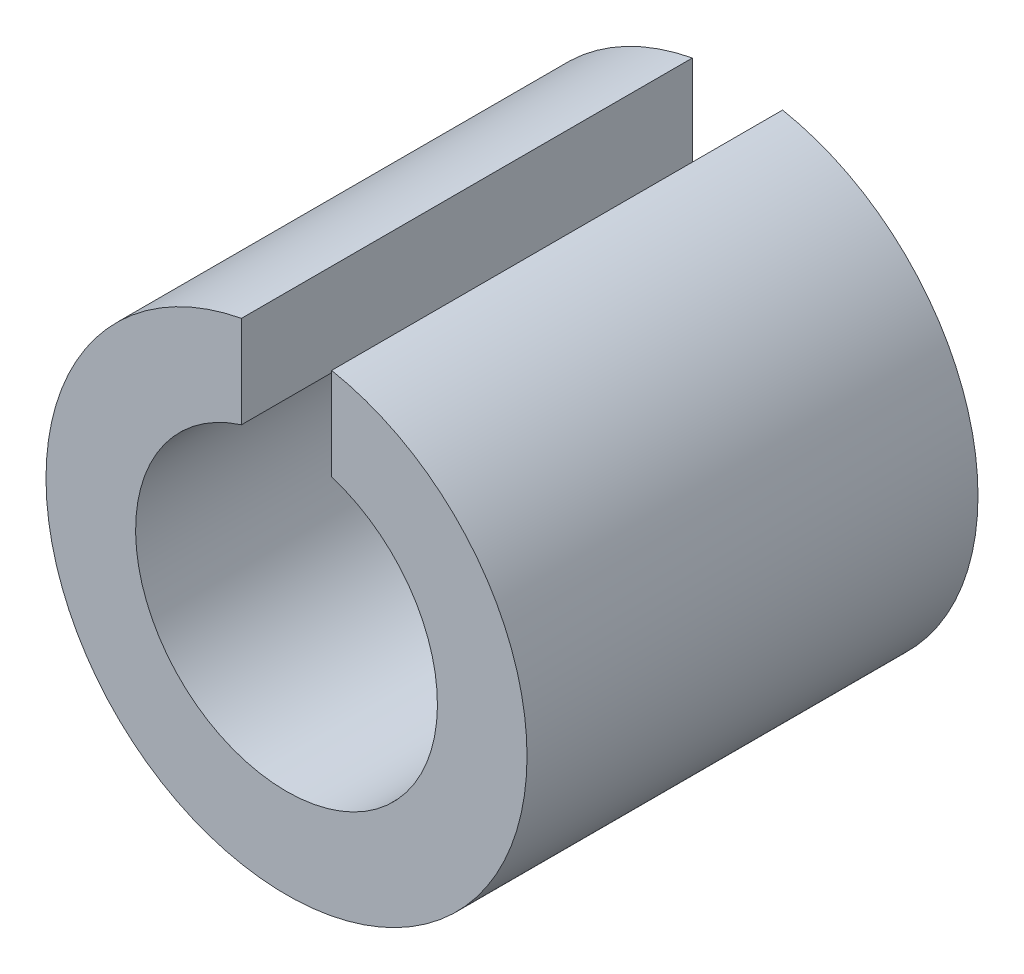
ISO-10303-21;
HEADER;
FILE_DESCRIPTION(('STEP AP214'),'2;1');
FILE_NAME('part.step','',(''),(''),'','','');
FILE_SCHEMA(('AUTOMOTIVE_DESIGN { 1 0 10303 214 1 1 1 1 }'));
ENDSEC;
DATA;
#1=APPLICATION_CONTEXT('core data for automotive mechanical design processes');
#2=APPLICATION_PROTOCOL_DEFINITION('international standard','automotive_design',2000,#1);
#3=PRODUCT_CONTEXT('',#1,'mechanical');
#4=PRODUCT('Part','Part','',(#3));
#5=PRODUCT_RELATED_PRODUCT_CATEGORY('part','',(#4));
#6=PRODUCT_DEFINITION_FORMATION('','',#4);
#7=PRODUCT_DEFINITION_CONTEXT('part definition',#1,'design');
#8=PRODUCT_DEFINITION('design','',#6,#7);
#9=PRODUCT_DEFINITION_SHAPE('','',#8);
#10=(LENGTH_UNIT() NAMED_UNIT(*) SI_UNIT(.MILLI.,.METRE.));
#11=(NAMED_UNIT(*) PLANE_ANGLE_UNIT() SI_UNIT($,.RADIAN.));
#12=(NAMED_UNIT(*) SI_UNIT($,.STERADIAN.) SOLID_ANGLE_UNIT());
#13=UNCERTAINTY_MEASURE_WITH_UNIT(LENGTH_MEASURE(1.E-05),#10,'distance_accuracy_value','');
#14=(GEOMETRIC_REPRESENTATION_CONTEXT(3) GLOBAL_UNCERTAINTY_ASSIGNED_CONTEXT((#13)) GLOBAL_UNIT_ASSIGNED_CONTEXT((#10,
#11,#12)) REPRESENTATION_CONTEXT('',''));
#15=CARTESIAN_POINT('',(0.,0.,0.));
#16=DIRECTION('',(0.,0.,1.));
#17=DIRECTION('',(1.,0.,0.));
#18=AXIS2_PLACEMENT_3D('',#15,#16,#17);
#19=CARTESIAN_POINT('',(0.75,3.92905841137543,3.75));
#20=DIRECTION('',(1.,0.,0.));
#21=DIRECTION('',(0.,1.,0.));
#22=AXIS2_PLACEMENT_3D('',#19,#20,#21);
#23=PLANE('',#22);
#24=DIRECTION('',(0.,0.,-1.));
#25=VECTOR('',#24,1.);
#26=CARTESIAN_POINT('',(0.75,2.39532878745278,3.75));
#27=LINE('',#26,#25);
#28=CARTESIAN_POINT('',(0.75,2.39532878745278,-3.75));
#29=VERTEX_POINT('',#28);
#30=CARTESIAN_POINT('',(0.75,2.39532878745278,3.75));
#31=VERTEX_POINT('',#30);
#32=EDGE_CURVE('E60',#29,#31,#27,.F.);
#33=ORIENTED_EDGE('',*,*,#32,.T.);
#34=DIRECTION('',(0.,1.,0.));
#35=VECTOR('',#34,1.);
#36=CARTESIAN_POINT('',(0.75,3.92905841137543,3.75));
#37=LINE('',#36,#35);
#38=CARTESIAN_POINT('',(0.75,3.92905841137543,3.75));
#39=VERTEX_POINT('',#38);
#40=EDGE_CURVE('E67',#39,#31,#37,.F.);
#41=ORIENTED_EDGE('',*,*,#40,.F.);
#42=DIRECTION('',(0.,0.,-1.));
#43=VECTOR('',#42,1.);
#44=CARTESIAN_POINT('',(0.75,3.92905841137543,3.75));
#45=LINE('',#44,#43);
#46=CARTESIAN_POINT('',(0.75,3.92905841137543,-3.75));
#47=VERTEX_POINT('',#46);
#48=EDGE_CURVE('E65',#47,#39,#45,.F.);
#49=ORIENTED_EDGE('',*,*,#48,.F.);
#50=DIRECTION('',(0.,1.,0.));
#51=VECTOR('',#50,1.);
#52=CARTESIAN_POINT('',(0.75,3.92905841137543,-3.75));
#53=LINE('',#52,#51);
#54=EDGE_CURVE('E35',#29,#47,#53,.T.);
#55=ORIENTED_EDGE('',*,*,#54,.F.);
#56=EDGE_LOOP('',(#33,#41,#49,#55));
#57=FACE_BOUND('',#56,.T.);
#58=ADVANCED_FACE('F17',(#57),#23,.F.);
#59=CARTESIAN_POINT('',(-0.75,2.39532878745278,3.75));
#60=DIRECTION('',(-1.,0.,0.));
#61=DIRECTION('',(0.,-1.,0.));
#62=AXIS2_PLACEMENT_3D('',#59,#60,#61);
#63=PLANE('',#62);
#64=DIRECTION('',(0.,0.,-1.));
#65=VECTOR('',#64,1.);
#66=CARTESIAN_POINT('',(-0.75,3.92905841137543,3.75));
#67=LINE('',#66,#65);
#68=CARTESIAN_POINT('',(-0.75,3.92905841137543,3.75));
#69=VERTEX_POINT('',#68);
#70=CARTESIAN_POINT('',(-0.75,3.92905841137543,-3.75));
#71=VERTEX_POINT('',#70);
#72=EDGE_CURVE('E77',#69,#71,#67,.T.);
#73=ORIENTED_EDGE('',*,*,#72,.F.);
#74=DIRECTION('',(0.,1.,0.));
#75=VECTOR('',#74,1.);
#76=CARTESIAN_POINT('',(-0.75,0.,3.75));
#77=LINE('',#76,#75);
#78=CARTESIAN_POINT('',(-0.75,2.39532878745278,3.75));
#79=VERTEX_POINT('',#78);
#80=EDGE_CURVE('E64',#79,#69,#77,.T.);
#81=ORIENTED_EDGE('',*,*,#80,.F.);
#82=DIRECTION('',(0.,0.,-1.));
#83=VECTOR('',#82,1.);
#84=CARTESIAN_POINT('',(-0.75,2.39532878745278,3.75));
#85=LINE('',#84,#83);
#86=CARTESIAN_POINT('',(-0.75,2.39532878745278,-3.75));
#87=VERTEX_POINT('',#86);
#88=EDGE_CURVE('E55',#79,#87,#85,.T.);
#89=ORIENTED_EDGE('',*,*,#88,.T.);
#90=DIRECTION('',(0.,-1.,0.));
#91=VECTOR('',#90,1.);
#92=CARTESIAN_POINT('',(-0.75,2.39532878745278,-3.75));
#93=LINE('',#92,#91);
#94=EDGE_CURVE('E73',#71,#87,#93,.T.);
#95=ORIENTED_EDGE('',*,*,#94,.F.);
#96=EDGE_LOOP('',(#73,#81,#89,#95));
#97=FACE_BOUND('',#96,.T.);
#98=ADVANCED_FACE('F89',(#97),#63,.F.);
#99=CARTESIAN_POINT('',(0.,0.,3.75));
#100=DIRECTION('',(0.,0.,-1.));
#101=DIRECTION('',(-1.,0.,0.));
#102=AXIS2_PLACEMENT_3D('',#99,#100,#101);
#103=CYLINDRICAL_SURFACE('',#102,2.51);
#104=CARTESIAN_POINT('',(0.,0.,3.75));
#105=DIRECTION('',(0.,0.,-1.));
#106=DIRECTION('',(-1.,0.,0.));
#107=AXIS2_PLACEMENT_3D('',#104,#105,#106);
#108=CIRCLE('',#107,2.51);
#109=EDGE_CURVE('E20',#31,#79,#108,.T.);
#110=ORIENTED_EDGE('',*,*,#109,.F.);
#111=ORIENTED_EDGE('',*,*,#32,.F.);
#112=CARTESIAN_POINT('',(0.,0.,-3.75));
#113=DIRECTION('',(0.,0.,-1.));
#114=DIRECTION('',(-1.,0.,0.));
#115=AXIS2_PLACEMENT_3D('',#112,#113,#114);
#116=CIRCLE('',#115,2.51);
#117=EDGE_CURVE('E79',#29,#87,#116,.T.);
#118=ORIENTED_EDGE('',*,*,#117,.T.);
#119=ORIENTED_EDGE('',*,*,#88,.F.);
#120=EDGE_LOOP('',(#110,#111,#118,#119));
#121=FACE_BOUND('',#120,.T.);
#122=ADVANCED_FACE('F59',(#121),#103,.F.);
#123=CARTESIAN_POINT('',(0.,0.,3.75));
#124=DIRECTION('',(0.,0.,1.));
#125=DIRECTION('',(1.,0.,0.));
#126=AXIS2_PLACEMENT_3D('',#123,#124,#125);
#127=PLANE('',#126);
#128=CARTESIAN_POINT('',(0.,0.,3.75));
#129=DIRECTION('',(0.,0.,-1.));
#130=DIRECTION('',(-1.,0.,0.));
#131=AXIS2_PLACEMENT_3D('',#128,#129,#130);
#132=CIRCLE('',#131,4.);
#133=EDGE_CURVE('E26',#39,#69,#132,.T.);
#134=ORIENTED_EDGE('',*,*,#133,.F.);
#135=ORIENTED_EDGE('',*,*,#40,.T.);
#136=ORIENTED_EDGE('',*,*,#109,.T.);
#137=ORIENTED_EDGE('',*,*,#80,.T.);
#138=EDGE_LOOP('',(#134,#135,#136,#137));
#139=FACE_BOUND('',#138,.T.);
#140=ADVANCED_FACE('F68',(#139),#127,.T.);
#141=CARTESIAN_POINT('',(0.,0.,-3.75));
#142=DIRECTION('',(0.,0.,1.));
#143=DIRECTION('',(1.,0.,0.));
#144=AXIS2_PLACEMENT_3D('',#141,#142,#143);
#145=PLANE('',#144);
#146=ORIENTED_EDGE('',*,*,#54,.T.);
#147=CARTESIAN_POINT('',(0.,0.,-3.75));
#148=DIRECTION('',(0.,0.,-1.));
#149=DIRECTION('',(-1.,0.,0.));
#150=AXIS2_PLACEMENT_3D('',#147,#148,#149);
#151=CIRCLE('',#150,4.);
#152=EDGE_CURVE('E11',#71,#47,#151,.F.);
#153=ORIENTED_EDGE('',*,*,#152,.F.);
#154=ORIENTED_EDGE('',*,*,#94,.T.);
#155=ORIENTED_EDGE('',*,*,#117,.F.);
#156=EDGE_LOOP('',(#146,#153,#154,#155));
#157=FACE_BOUND('',#156,.T.);
#158=ADVANCED_FACE('F86',(#157),#145,.F.);
#159=CARTESIAN_POINT('',(0.,0.,3.75));
#160=DIRECTION('',(0.,0.,-1.));
#161=DIRECTION('',(-1.,0.,0.));
#162=AXIS2_PLACEMENT_3D('',#159,#160,#161);
#163=CYLINDRICAL_SURFACE('',#162,4.);
#164=ORIENTED_EDGE('',*,*,#133,.T.);
#165=ORIENTED_EDGE('',*,*,#72,.T.);
#166=ORIENTED_EDGE('',*,*,#152,.T.);
#167=ORIENTED_EDGE('',*,*,#48,.T.);
#168=EDGE_LOOP('',(#164,#165,#166,#167));
#169=FACE_BOUND('',#168,.T.);
#170=ADVANCED_FACE('F91',(#169),#163,.T.);
#171=CLOSED_SHELL('',(#58,#98,#122,#140,#158,#170));
#172=MANIFOLD_SOLID_BREP('B1',#171);
#173=ADVANCED_BREP_SHAPE_REPRESENTATION('',(#18,#172),#14);
#174=SHAPE_DEFINITION_REPRESENTATION(#9,#173);
ENDSEC;
END-ISO-10303-21;
